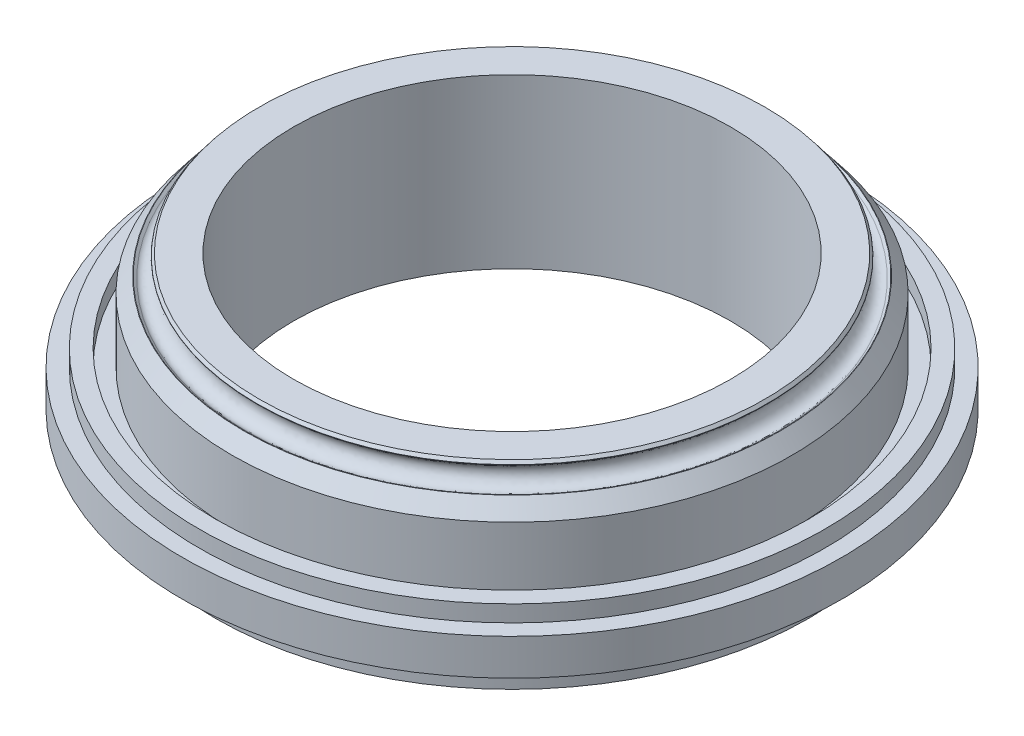
ISO-10303-21;
HEADER;
FILE_DESCRIPTION(('STEP AP214'),'2;1');
FILE_NAME('part.step','',(''),(''),'','','');
FILE_SCHEMA(('AUTOMOTIVE_DESIGN { 1 0 10303 214 1 1 1 1 }'));
ENDSEC;
DATA;
#1=APPLICATION_CONTEXT('core data for automotive mechanical design processes');
#2=APPLICATION_PROTOCOL_DEFINITION('international standard','automotive_design',2000,#1);
#3=PRODUCT_CONTEXT('',#1,'mechanical');
#4=PRODUCT('Part','Part','',(#3));
#5=PRODUCT_RELATED_PRODUCT_CATEGORY('part','',(#4));
#6=PRODUCT_DEFINITION_FORMATION('','',#4);
#7=PRODUCT_DEFINITION_CONTEXT('part definition',#1,'design');
#8=PRODUCT_DEFINITION('design','',#6,#7);
#9=PRODUCT_DEFINITION_SHAPE('','',#8);
#10=(LENGTH_UNIT() NAMED_UNIT(*) SI_UNIT(.MILLI.,.METRE.));
#11=(NAMED_UNIT(*) PLANE_ANGLE_UNIT() SI_UNIT($,.RADIAN.));
#12=(NAMED_UNIT(*) SI_UNIT($,.STERADIAN.) SOLID_ANGLE_UNIT());
#13=UNCERTAINTY_MEASURE_WITH_UNIT(LENGTH_MEASURE(1.E-05),#10,'distance_accuracy_value','');
#14=(GEOMETRIC_REPRESENTATION_CONTEXT(3) GLOBAL_UNCERTAINTY_ASSIGNED_CONTEXT((#13)) GLOBAL_UNIT_ASSIGNED_CONTEXT((#10,
#11,#12)) REPRESENTATION_CONTEXT('',''));
#15=CARTESIAN_POINT('',(0.,0.,0.));
#16=DIRECTION('',(0.,0.,1.));
#17=DIRECTION('',(1.,0.,0.));
#18=AXIS2_PLACEMENT_3D('',#15,#16,#17);
#19=CARTESIAN_POINT('',(78.55,-10.2623786743654,0.));
#20=DIRECTION('',(0.,0.,1.));
#21=DIRECTION('',(1.,0.,0.));
#22=AXIS2_PLACEMENT_3D('',#19,#20,#21);
#23=ELLIPSE('',#22,3.25,2.165);
#24=CARTESIAN_POINT('',(0.,0.,0.));
#25=DIRECTION('',(0.,-1.,0.));
#26=AXIS1_PLACEMENT('',#24,#25);
#27=SURFACE_OF_REVOLUTION('',#23,#26);
#28=CARTESIAN_POINT('',(0.,-10.2623786743654,0.));
#29=DIRECTION('',(0.,-1.,0.));
#30=DIRECTION('',(0.,0.,-1.));
#31=AXIS2_PLACEMENT_3D('',#28,#29,#30);
#32=CIRCLE('',#31,75.3);
#33=CARTESIAN_POINT('',(0.,-10.2623786743654,-75.3));
#34=VERTEX_POINT('',#33);
#35=EDGE_CURVE('E109',#34,#34,#32,.T.);
#36=ORIENTED_EDGE('',*,*,#35,.F.);
#37=EDGE_LOOP('',(#36));
#38=FACE_BOUND('',#37,.T.);
#39=CARTESIAN_POINT('',(0.,-10.2623786743654,0.));
#40=DIRECTION('',(0.,-1.,0.));
#41=DIRECTION('',(0.,0.,-1.));
#42=AXIS2_PLACEMENT_3D('',#39,#40,#41);
#43=CIRCLE('',#42,81.8);
#44=CARTESIAN_POINT('',(0.,-10.2623786743654,-81.8));
#45=VERTEX_POINT('',#44);
#46=EDGE_CURVE('E61',#45,#45,#43,.T.);
#47=ORIENTED_EDGE('',*,*,#46,.T.);
#48=EDGE_LOOP('',(#47));
#49=FACE_BOUND('',#48,.T.);
#50=ADVANCED_FACE('F41',(#38,#49),#27,.T.);
#51=CARTESIAN_POINT('',(0.,-10.2623786743654,0.));
#52=DIRECTION('',(0.,-1.,0.));
#53=DIRECTION('',(0.,0.,-1.));
#54=AXIS2_PLACEMENT_3D('',#51,#52,#53);
#55=PLANE('',#54);
#56=CARTESIAN_POINT('',(0.,-10.2623786743654,85.));
#57=DIRECTION('',(0.,-1.,0.));
#58=DIRECTION('',(0.,0.,-1.));
#59=AXIS2_PLACEMENT_3D('',#56,#57,#58);
#60=CIRCLE('',#59,1.55);
#61=CARTESIAN_POINT('',(0.,-10.2623786743654,83.45));
#62=VERTEX_POINT('',#61);
#63=EDGE_CURVE('E305',#62,#62,#60,.T.);
#64=ORIENTED_EDGE('',*,*,#63,.F.);
#65=EDGE_LOOP('',(#64));
#66=FACE_BOUND('',#65,.T.);
#67=CARTESIAN_POINT('',(-42.4999999999991,-10.2623786743654,73.6121593216778));
#68=DIRECTION('',(0.,-1.,0.));
#69=DIRECTION('',(0.,0.,-1.));
#70=AXIS2_PLACEMENT_3D('',#67,#68,#69);
#71=CIRCLE('',#70,1.55);
#72=CARTESIAN_POINT('',(-42.4999999999991,-10.2623786743654,72.0621593216778));
#73=VERTEX_POINT('',#72);
#74=EDGE_CURVE('E324',#73,#73,#71,.T.);
#75=ORIENTED_EDGE('',*,*,#74,.F.);
#76=EDGE_LOOP('',(#75));
#77=FACE_BOUND('',#76,.T.);
#78=CARTESIAN_POINT('',(-73.6121593216768,-10.2623786743654,42.5000000000009));
#79=DIRECTION('',(0.,-1.,0.));
#80=DIRECTION('',(0.,0.,-1.));
#81=AXIS2_PLACEMENT_3D('',#78,#79,#80);
#82=CIRCLE('',#81,1.54999999999999);
#83=CARTESIAN_POINT('',(-73.6121593216768,-10.2623786743654,40.9500000000009));
#84=VERTEX_POINT('',#83);
#85=EDGE_CURVE('E318',#84,#84,#82,.T.);
#86=ORIENTED_EDGE('',*,*,#85,.F.);
#87=EDGE_LOOP('',(#86));
#88=FACE_BOUND('',#87,.T.);
#89=CARTESIAN_POINT('',(-85.,-10.2623786743654,8.90327741404999E-13));
#90=DIRECTION('',(0.,-1.,0.));
#91=DIRECTION('',(0.,0.,-1.));
#92=AXIS2_PLACEMENT_3D('',#89,#90,#91);
#93=CIRCLE('',#92,1.55);
#94=CARTESIAN_POINT('',(-85.,-10.2623786743654,-1.54999999999911));
#95=VERTEX_POINT('',#94);
#96=EDGE_CURVE('E311',#95,#95,#93,.T.);
#97=ORIENTED_EDGE('',*,*,#96,.F.);
#98=EDGE_LOOP('',(#97));
#99=FACE_BOUND('',#98,.T.);
#100=CARTESIAN_POINT('',(42.5000000000001,-10.2623786743654,73.6121593216772));
#101=DIRECTION('',(0.,-1.,0.));
#102=DIRECTION('',(0.,0.,-1.));
#103=AXIS2_PLACEMENT_3D('',#100,#101,#102);
#104=CIRCLE('',#103,1.55);
#105=CARTESIAN_POINT('',(42.5000000000001,-10.2623786743654,72.0621593216772));
#106=VERTEX_POINT('',#105);
#107=EDGE_CURVE('E308',#106,#106,#104,.T.);
#108=ORIENTED_EDGE('',*,*,#107,.F.);
#109=EDGE_LOOP('',(#108));
#110=FACE_BOUND('',#109,.T.);
#111=CARTESIAN_POINT('',(73.6121593216774,-10.2623786743654,42.4999999999998));
#112=DIRECTION('',(0.,-1.,0.));
#113=DIRECTION('',(0.,0.,-1.));
#114=AXIS2_PLACEMENT_3D('',#111,#112,#113);
#115=CIRCLE('',#114,1.55);
#116=CARTESIAN_POINT('',(73.6121593216774,-10.2623786743654,40.9499999999998));
#117=VERTEX_POINT('',#116);
#118=EDGE_CURVE('E359',#117,#117,#115,.T.);
#119=ORIENTED_EDGE('',*,*,#118,.F.);
#120=EDGE_LOOP('',(#119));
#121=FACE_BOUND('',#120,.T.);
#122=CARTESIAN_POINT('',(85.,-10.2623786743654,-2.96775913801666E-13));
#123=DIRECTION('',(0.,-1.,0.));
#124=DIRECTION('',(0.,0.,-1.));
#125=AXIS2_PLACEMENT_3D('',#122,#123,#124);
#126=CIRCLE('',#125,1.55);
#127=CARTESIAN_POINT('',(85.,-10.2623786743654,-1.5500000000003));
#128=VERTEX_POINT('',#127);
#129=EDGE_CURVE('E365',#128,#128,#126,.T.);
#130=ORIENTED_EDGE('',*,*,#129,.F.);
#131=EDGE_LOOP('',(#130));
#132=FACE_BOUND('',#131,.T.);
#133=CARTESIAN_POINT('',(73.6121593216771,-10.2623786743654,-42.5000000000003));
#134=DIRECTION('',(0.,-1.,0.));
#135=DIRECTION('',(0.,0.,-1.));
#136=AXIS2_PLACEMENT_3D('',#133,#134,#135);
#137=CIRCLE('',#136,1.55000000000001);
#138=CARTESIAN_POINT('',(73.6121593216771,-10.2623786743654,-44.0500000000004));
#139=VERTEX_POINT('',#138);
#140=EDGE_CURVE('E371',#139,#139,#137,.T.);
#141=ORIENTED_EDGE('',*,*,#140,.F.);
#142=EDGE_LOOP('',(#141));
#143=FACE_BOUND('',#142,.T.);
#144=CARTESIAN_POINT('',(42.4999999999996,-10.2623786743654,-73.6121593216776));
#145=DIRECTION('',(0.,-1.,0.));
#146=DIRECTION('',(0.,0.,-1.));
#147=AXIS2_PLACEMENT_3D('',#144,#145,#146);
#148=CIRCLE('',#147,1.55);
#149=CARTESIAN_POINT('',(42.4999999999996,-10.2623786743654,-75.1621593216775));
#150=VERTEX_POINT('',#149);
#151=EDGE_CURVE('E330',#150,#150,#148,.T.);
#152=ORIENTED_EDGE('',*,*,#151,.F.);
#153=EDGE_LOOP('',(#152));
#154=FACE_BOUND('',#153,.T.);
#155=CARTESIAN_POINT('',(-5.93551827603333E-13,-10.2623786743654,-85.));
#156=DIRECTION('',(0.,-1.,0.));
#157=DIRECTION('',(0.,0.,-1.));
#158=AXIS2_PLACEMENT_3D('',#155,#156,#157);
#159=CIRCLE('',#158,1.55);
#160=CARTESIAN_POINT('',(-5.93551827603333E-13,-10.2623786743654,-86.55));
#161=VERTEX_POINT('',#160);
#162=EDGE_CURVE('E337',#161,#161,#159,.T.);
#163=ORIENTED_EDGE('',*,*,#162,.F.);
#164=EDGE_LOOP('',(#163));
#165=FACE_BOUND('',#164,.T.);
#166=CARTESIAN_POINT('',(-42.5000000000006,-10.2623786743654,-73.612159321677));
#167=DIRECTION('',(0.,-1.,0.));
#168=DIRECTION('',(0.,0.,-1.));
#169=AXIS2_PLACEMENT_3D('',#166,#167,#168);
#170=CIRCLE('',#169,1.55);
#171=CARTESIAN_POINT('',(-42.5000000000006,-10.2623786743654,-75.162159321677));
#172=VERTEX_POINT('',#171);
#173=EDGE_CURVE('E343',#172,#172,#170,.T.);
#174=ORIENTED_EDGE('',*,*,#173,.F.);
#175=EDGE_LOOP('',(#174));
#176=FACE_BOUND('',#175,.T.);
#177=CARTESIAN_POINT('',(-73.6121593216777,-10.2623786743654,-42.4999999999993));
#178=DIRECTION('',(0.,-1.,0.));
#179=DIRECTION('',(0.,0.,-1.));
#180=AXIS2_PLACEMENT_3D('',#177,#178,#179);
#181=CIRCLE('',#180,1.54999999999999);
#182=CARTESIAN_POINT('',(-73.6121593216777,-10.2623786743654,-44.0499999999993));
#183=VERTEX_POINT('',#182);
#184=EDGE_CURVE('E349',#183,#183,#181,.T.);
#185=ORIENTED_EDGE('',*,*,#184,.F.);
#186=EDGE_LOOP('',(#185));
#187=FACE_BOUND('',#186,.T.);
#188=CARTESIAN_POINT('',(0.,-10.2623786743654,0.));
#189=DIRECTION('',(0.,-1.,0.));
#190=DIRECTION('',(0.,0.,-1.));
#191=AXIS2_PLACEMENT_3D('',#188,#189,#190);
#192=CIRCLE('',#191,90.);
#193=CARTESIAN_POINT('',(0.,-10.2623786743654,-90.));
#194=VERTEX_POINT('',#193);
#195=EDGE_CURVE('E64',#194,#194,#192,.T.);
#196=ORIENTED_EDGE('',*,*,#195,.T.);
#197=EDGE_LOOP('',(#196));
#198=FACE_BOUND('',#197,.T.);
#199=ORIENTED_EDGE('',*,*,#46,.F.);
#200=EDGE_LOOP('',(#199));
#201=FACE_BOUND('',#200,.T.);
#202=ADVANCED_FACE('F166',(#66,#77,#88,#99,#110,#121,#132,#143,#154,#165,#176,#187,#198,#201),
#55,.T.);
#203=CARTESIAN_POINT('',(0.,0.,0.));
#204=DIRECTION('',(0.,-1.,0.));
#205=DIRECTION('',(0.,0.,-1.));
#206=AXIS2_PLACEMENT_3D('',#203,#204,#205);
#207=CYLINDRICAL_SURFACE('',#206,90.);
#208=CARTESIAN_POINT('',(0.,-0.26237867436537,0.));
#209=DIRECTION('',(0.,-1.,0.));
#210=DIRECTION('',(0.,0.,-1.));
#211=AXIS2_PLACEMENT_3D('',#208,#209,#210);
#212=CIRCLE('',#211,90.);
#213=CARTESIAN_POINT('',(0.,-0.26237867436537,-90.));
#214=VERTEX_POINT('',#213);
#215=EDGE_CURVE('E67',#214,#214,#212,.T.);
#216=ORIENTED_EDGE('',*,*,#215,.T.);
#217=EDGE_LOOP('',(#216));
#218=FACE_BOUND('',#217,.T.);
#219=ORIENTED_EDGE('',*,*,#195,.F.);
#220=EDGE_LOOP('',(#219));
#221=FACE_BOUND('',#220,.T.);
#222=ADVANCED_FACE('F162',(#218,#221),#207,.T.);
#223=CARTESIAN_POINT('',(0.,-0.262378674365373,0.));
#224=DIRECTION('',(0.,-1.,0.));
#225=DIRECTION('',(0.,0.,-1.));
#226=AXIS2_PLACEMENT_3D('',#223,#224,#225);
#227=PLANE('',#226);
#228=CARTESIAN_POINT('',(0.,-0.262378674365377,0.));
#229=DIRECTION('',(0.,-1.,0.));
#230=DIRECTION('',(0.,0.,-1.));
#231=AXIS2_PLACEMENT_3D('',#228,#229,#230);
#232=CIRCLE('',#231,100.);
#233=CARTESIAN_POINT('',(0.,-0.262378674365377,-100.));
#234=VERTEX_POINT('',#233);
#235=EDGE_CURVE('E70',#234,#234,#232,.T.);
#236=ORIENTED_EDGE('',*,*,#235,.T.);
#237=EDGE_LOOP('',(#236));
#238=FACE_BOUND('',#237,.T.);
#239=ORIENTED_EDGE('',*,*,#215,.F.);
#240=EDGE_LOOP('',(#239));
#241=FACE_BOUND('',#240,.T.);
#242=ADVANCED_FACE('F158',(#238,#241),#227,.T.);
#243=CARTESIAN_POINT('',(0.,0.,0.));
#244=DIRECTION('',(0.,-1.,0.));
#245=DIRECTION('',(0.,0.,-1.));
#246=AXIS2_PLACEMENT_3D('',#243,#244,#245);
#247=CYLINDRICAL_SURFACE('',#246,100.);
#248=ORIENTED_EDGE('',*,*,#235,.F.);
#249=EDGE_LOOP('',(#248));
#250=FACE_BOUND('',#249,.T.);
#251=CARTESIAN_POINT('',(0.,10.7376213256346,0.));
#252=DIRECTION('',(0.,-1.,0.));
#253=DIRECTION('',(0.,0.,-1.));
#254=AXIS2_PLACEMENT_3D('',#251,#252,#253);
#255=CIRCLE('',#254,100.);
#256=CARTESIAN_POINT('',(0.,10.7376213256346,-100.));
#257=VERTEX_POINT('',#256);
#258=EDGE_CURVE('E73',#257,#257,#255,.T.);
#259=ORIENTED_EDGE('',*,*,#258,.T.);
#260=EDGE_LOOP('',(#259));
#261=FACE_BOUND('',#260,.T.);
#262=ADVANCED_FACE('F154',(#250,#261),#247,.T.);
#263=CARTESIAN_POINT('',(0.,10.7376213256346,0.));
#264=DIRECTION('',(0.,-1.,0.));
#265=DIRECTION('',(0.,0.,-1.));
#266=AXIS2_PLACEMENT_3D('',#263,#264,#265);
#267=PLANE('',#266);
#268=ORIENTED_EDGE('',*,*,#258,.F.);
#269=EDGE_LOOP('',(#268));
#270=FACE_BOUND('',#269,.T.);
#271=CARTESIAN_POINT('',(0.,10.7376213256346,0.));
#272=DIRECTION('',(0.,-1.,0.));
#273=DIRECTION('',(0.,0.,-1.));
#274=AXIS2_PLACEMENT_3D('',#271,#272,#273);
#275=CIRCLE('',#274,95.);
#276=CARTESIAN_POINT('',(0.,10.7376213256346,-95.));
#277=VERTEX_POINT('',#276);
#278=EDGE_CURVE('E76',#277,#277,#275,.T.);
#279=ORIENTED_EDGE('',*,*,#278,.T.);
#280=EDGE_LOOP('',(#279));
#281=FACE_BOUND('',#280,.T.);
#282=ADVANCED_FACE('F150',(#270,#281),#267,.F.);
#283=CARTESIAN_POINT('',(0.,0.,0.));
#284=DIRECTION('',(0.,-1.,0.));
#285=DIRECTION('',(0.,0.,-1.));
#286=AXIS2_PLACEMENT_3D('',#283,#284,#285);
#287=CYLINDRICAL_SURFACE('',#286,95.);
#288=ORIENTED_EDGE('',*,*,#278,.F.);
#289=EDGE_LOOP('',(#288));
#290=FACE_BOUND('',#289,.T.);
#291=CARTESIAN_POINT('',(0.,15.7376213256346,0.));
#292=DIRECTION('',(0.,-1.,0.));
#293=DIRECTION('',(0.,0.,-1.));
#294=AXIS2_PLACEMENT_3D('',#291,#292,#293);
#295=CIRCLE('',#294,95.);
#296=CARTESIAN_POINT('',(0.,15.7376213256346,-95.));
#297=VERTEX_POINT('',#296);
#298=EDGE_CURVE('E79',#297,#297,#295,.T.);
#299=ORIENTED_EDGE('',*,*,#298,.T.);
#300=EDGE_LOOP('',(#299));
#301=FACE_BOUND('',#300,.T.);
#302=ADVANCED_FACE('F146',(#290,#301),#287,.T.);
#303=CARTESIAN_POINT('',(0.,15.7376213256346,0.));
#304=DIRECTION('',(0.,-1.,0.));
#305=DIRECTION('',(0.,0.,-1.));
#306=AXIS2_PLACEMENT_3D('',#303,#304,#305);
#307=PLANE('',#306);
#308=ORIENTED_EDGE('',*,*,#298,.F.);
#309=EDGE_LOOP('',(#308));
#310=FACE_BOUND('',#309,.T.);
#311=CARTESIAN_POINT('',(0.,15.7376213256346,0.));
#312=DIRECTION('',(0.,-1.,0.));
#313=DIRECTION('',(0.,0.,-1.));
#314=AXIS2_PLACEMENT_3D('',#311,#312,#313);
#315=CIRCLE('',#314,89.9);
#316=CARTESIAN_POINT('',(0.,15.7376213256346,-89.9));
#317=VERTEX_POINT('',#316);
#318=EDGE_CURVE('E82',#317,#317,#315,.T.);
#319=ORIENTED_EDGE('',*,*,#318,.T.);
#320=EDGE_LOOP('',(#319));
#321=FACE_BOUND('',#320,.T.);
#322=ADVANCED_FACE('F142',(#310,#321),#307,.F.);
#323=CARTESIAN_POINT('',(0.,0.,0.));
#324=DIRECTION('',(0.,-1.,0.));
#325=DIRECTION('',(0.,0.,-1.));
#326=AXIS2_PLACEMENT_3D('',#323,#324,#325);
#327=CYLINDRICAL_SURFACE('',#326,89.9);
#328=ORIENTED_EDGE('',*,*,#318,.F.);
#329=EDGE_LOOP('',(#328));
#330=FACE_BOUND('',#329,.T.);
#331=CARTESIAN_POINT('',(0.,10.7376213256346,0.));
#332=DIRECTION('',(0.,-1.,0.));
#333=DIRECTION('',(0.,0.,-1.));
#334=AXIS2_PLACEMENT_3D('',#331,#332,#333);
#335=CIRCLE('',#334,89.9);
#336=CARTESIAN_POINT('',(0.,10.7376213256346,-89.9));
#337=VERTEX_POINT('',#336);
#338=EDGE_CURVE('E85',#337,#337,#335,.T.);
#339=ORIENTED_EDGE('',*,*,#338,.T.);
#340=EDGE_LOOP('',(#339));
#341=FACE_BOUND('',#340,.T.);
#342=ADVANCED_FACE('F138',(#330,#341),#327,.F.);
#343=CARTESIAN_POINT('',(0.,10.7376213256346,0.));
#344=DIRECTION('',(0.,-1.,0.));
#345=DIRECTION('',(0.,0.,-1.));
#346=AXIS2_PLACEMENT_3D('',#343,#344,#345);
#347=PLANE('',#346);
#348=ORIENTED_EDGE('',*,*,#338,.F.);
#349=EDGE_LOOP('',(#348));
#350=FACE_BOUND('',#349,.T.);
#351=CARTESIAN_POINT('',(0.,10.7376213256346,0.));
#352=DIRECTION('',(0.,-1.,0.));
#353=DIRECTION('',(0.,0.,-1.));
#354=AXIS2_PLACEMENT_3D('',#351,#352,#353);
#355=CIRCLE('',#354,84.99);
#356=CARTESIAN_POINT('',(0.,10.7376213256346,-84.99));
#357=VERTEX_POINT('',#356);
#358=EDGE_CURVE('E88',#357,#357,#355,.T.);
#359=ORIENTED_EDGE('',*,*,#358,.T.);
#360=EDGE_LOOP('',(#359));
#361=FACE_BOUND('',#360,.T.);
#362=ADVANCED_FACE('F134',(#350,#361),#347,.F.);
#363=CARTESIAN_POINT('',(0.,0.,0.));
#364=DIRECTION('',(0.,-1.,0.));
#365=DIRECTION('',(0.,0.,-1.));
#366=AXIS2_PLACEMENT_3D('',#363,#364,#365);
#367=CYLINDRICAL_SURFACE('',#366,84.99);
#368=CARTESIAN_POINT('',(0.,30.1174995072672,0.));
#369=DIRECTION('',(0.,-1.,0.));
#370=DIRECTION('',(0.,0.,-1.));
#371=AXIS2_PLACEMENT_3D('',#368,#369,#370);
#372=CIRCLE('',#371,84.99);
#373=CARTESIAN_POINT('',(0.,30.1174995072672,-84.99));
#374=VERTEX_POINT('',#373);
#375=EDGE_CURVE('E91',#374,#374,#372,.T.);
#376=ORIENTED_EDGE('',*,*,#375,.T.);
#377=EDGE_LOOP('',(#376));
#378=FACE_BOUND('',#377,.T.);
#379=ORIENTED_EDGE('',*,*,#358,.F.);
#380=EDGE_LOOP('',(#379));
#381=FACE_BOUND('',#380,.T.);
#382=ADVANCED_FACE('F131',(#378,#381),#367,.T.);
#383=CARTESIAN_POINT('',(0.,34.7953666700846,0.));
#384=DIRECTION('',(0.,-1.,0.));
#385=DIRECTION('',(0.,0.,-1.));
#386=AXIS2_PLACEMENT_3D('',#383,#384,#385);
#387=CONICAL_SURFACE('',#386,81.3640889335616,0.659385391403457);
#388=CARTESIAN_POINT('',(0.,34.7163297791692,0.));
#389=DIRECTION('',(0.,1.,0.));
#390=DIRECTION('',(0.,0.,1.));
#391=AXIS2_PLACEMENT_3D('',#388,#389,#390);
#392=CIRCLE('',#391,81.4253520535803);
#393=CARTESIAN_POINT('',(0.,34.7163297791692,81.4253520535803));
#394=VERTEX_POINT('',#393);
#395=EDGE_CURVE('E48',#394,#394,#392,.F.);
#396=ORIENTED_EDGE('',*,*,#395,.T.);
#397=EDGE_LOOP('',(#396));
#398=FACE_BOUND('',#397,.T.);
#399=ORIENTED_EDGE('',*,*,#375,.F.);
#400=EDGE_LOOP('',(#399));
#401=FACE_BOUND('',#400,.T.);
#402=ADVANCED_FACE('F128',(#398,#401),#387,.T.);
#403=CARTESIAN_POINT('',(0.,34.1423018106855,0.));
#404=DIRECTION('',(0.,1.,0.));
#405=DIRECTION('',(0.,0.,1.));
#406=AXIS2_PLACEMENT_3D('',#403,#404,#405);
#407=CONICAL_SURFACE('',#406,80.5215556764033,0.911410935391438);
#408=CARTESIAN_POINT('',(0.,34.7341035500659,0.));
#409=DIRECTION('',(0.,-1.,0.));
#410=DIRECTION('',(0.,0.,-1.));
#411=AXIS2_PLACEMENT_3D('',#408,#409,#410);
#412=CIRCLE('',#411,81.2850520426462);
#413=CARTESIAN_POINT('',(0.,34.7341035500659,-81.2850520426462));
#414=VERTEX_POINT('',#413);
#415=EDGE_CURVE('E10',#414,#414,#412,.F.);
#416=ORIENTED_EDGE('',*,*,#415,.T.);
#417=EDGE_LOOP('',(#416));
#418=FACE_BOUND('',#417,.T.);
#419=CARTESIAN_POINT('',(0.,34.1423018106855,0.));
#420=DIRECTION('',(0.,-1.,0.));
#421=DIRECTION('',(0.,0.,-1.));
#422=AXIS2_PLACEMENT_3D('',#419,#420,#421);
#423=CIRCLE('',#422,80.5215556764033);
#424=CARTESIAN_POINT('',(0.,34.1423018106855,-80.5215556764033));
#425=VERTEX_POINT('',#424);
#426=EDGE_CURVE('E94',#425,#425,#423,.T.);
#427=ORIENTED_EDGE('',*,*,#426,.T.);
#428=EDGE_LOOP('',(#427));
#429=FACE_BOUND('',#428,.T.);
#430=ADVANCED_FACE('F123',(#418,#429),#407,.F.);
#431=CARTESIAN_POINT('',(78.5764516158101,36.6517230972502,0.));
#432=DIRECTION('',(0.,0.,1.));
#433=DIRECTION('',(-0.612631200186792,0.790368909154258,0.));
#434=AXIS2_PLACEMENT_3D('',#431,#432,#433);
#435=ELLIPSE('',#434,3.17500000000002,2.67499999999992);
#436=CARTESIAN_POINT('',(0.,0.,0.));
#437=DIRECTION('',(0.,-1.,0.));
#438=AXIS1_PLACEMENT('',#436,#437);
#439=SURFACE_OF_REVOLUTION('',#435,#438);
#440=ORIENTED_EDGE('',*,*,#426,.F.);
#441=EDGE_LOOP('',(#440));
#442=FACE_BOUND('',#441,.T.);
#443=CARTESIAN_POINT('',(0.,39.161144383815,0.));
#444=DIRECTION('',(0.,-1.,0.));
#445=DIRECTION('',(0.,0.,-1.));
#446=AXIS2_PLACEMENT_3D('',#443,#444,#445);
#447=CIRCLE('',#446,76.631347555217);
#448=CARTESIAN_POINT('',(0.,39.161144383815,-76.631347555217));
#449=VERTEX_POINT('',#448);
#450=EDGE_CURVE('E97',#449,#449,#447,.T.);
#451=ORIENTED_EDGE('',*,*,#450,.T.);
#452=EDGE_LOOP('',(#451));
#453=FACE_BOUND('',#452,.T.);
#454=ADVANCED_FACE('F118',(#442,#453),#439,.T.);
#455=CARTESIAN_POINT('',(0.,39.161144383815,0.));
#456=DIRECTION('',(0.,1.,0.));
#457=DIRECTION('',(0.,0.,1.));
#458=AXIS2_PLACEMENT_3D('',#455,#456,#457);
#459=CONICAL_SURFACE('',#458,76.631347555217,0.911410935391446);
#460=CARTESIAN_POINT('',(0.,39.7529461231954,0.));
#461=DIRECTION('',(0.,1.,0.));
#462=DIRECTION('',(0.,0.,1.));
#463=AXIS2_PLACEMENT_3D('',#460,#461,#462);
#464=CIRCLE('',#463,77.39484392146);
#465=CARTESIAN_POINT('',(0.,39.7529461231954,77.39484392146));
#466=VERTEX_POINT('',#465);
#467=EDGE_CURVE('E56',#466,#466,#464,.F.);
#468=ORIENTED_EDGE('',*,*,#467,.T.);
#469=EDGE_LOOP('',(#468));
#470=FACE_BOUND('',#469,.T.);
#471=ORIENTED_EDGE('',*,*,#450,.F.);
#472=EDGE_LOOP('',(#471));
#473=FACE_BOUND('',#472,.T.);
#474=ADVANCED_FACE('F122',(#470,#473),#459,.T.);
#475=CARTESIAN_POINT('',(0.,40.74810371,0.));
#476=DIRECTION('',(0.,-1.,0.));
#477=DIRECTION('',(0.,0.,-1.));
#478=AXIS2_PLACEMENT_3D('',#475,#476,#477);
#479=CONICAL_SURFACE('',#478,76.75,0.659385391403443);
#480=CARTESIAN_POINT('',(0.,39.8932461341295,0.));
#481=DIRECTION('',(0.,-1.,0.));
#482=DIRECTION('',(0.,0.,-1.));
#483=AXIS2_PLACEMENT_3D('',#480,#481,#482);
#484=CIRCLE('',#483,77.4126176923568);
#485=CARTESIAN_POINT('',(0.,39.8932461341295,-77.4126176923568));
#486=VERTEX_POINT('',#485);
#487=EDGE_CURVE('E52',#486,#486,#484,.F.);
#488=ORIENTED_EDGE('',*,*,#487,.T.);
#489=EDGE_LOOP('',(#488));
#490=FACE_BOUND('',#489,.T.);
#491=CARTESIAN_POINT('',(0.,40.74810371,0.));
#492=DIRECTION('',(0.,-1.,0.));
#493=DIRECTION('',(0.,0.,-1.));
#494=AXIS2_PLACEMENT_3D('',#491,#492,#493);
#495=CIRCLE('',#494,76.75);
#496=CARTESIAN_POINT('',(0.,40.74810371,-76.75));
#497=VERTEX_POINT('',#496);
#498=EDGE_CURVE('E100',#497,#497,#495,.T.);
#499=ORIENTED_EDGE('',*,*,#498,.T.);
#500=EDGE_LOOP('',(#499));
#501=FACE_BOUND('',#500,.T.);
#502=ADVANCED_FACE('F190',(#490,#501),#479,.T.);
#503=CARTESIAN_POINT('',(0.,40.74810371,0.));
#504=DIRECTION('',(0.,-1.,0.));
#505=DIRECTION('',(0.,0.,-1.));
#506=AXIS2_PLACEMENT_3D('',#503,#504,#505);
#507=PLANE('',#506);
#508=ORIENTED_EDGE('',*,*,#498,.F.);
#509=EDGE_LOOP('',(#508));
#510=FACE_BOUND('',#509,.T.);
#511=CARTESIAN_POINT('',(0.,40.74810371,0.));
#512=DIRECTION('',(0.,-1.,0.));
#513=DIRECTION('',(0.,0.,-1.));
#514=AXIS2_PLACEMENT_3D('',#511,#512,#513);
#515=CIRCLE('',#514,66.3264516158101);
#516=CARTESIAN_POINT('',(0.,40.74810371,-66.3264516158101));
#517=VERTEX_POINT('',#516);
#518=EDGE_CURVE('E103',#517,#517,#515,.T.);
#519=ORIENTED_EDGE('',*,*,#518,.T.);
#520=EDGE_LOOP('',(#519));
#521=FACE_BOUND('',#520,.T.);
#522=ADVANCED_FACE('F195',(#510,#521),#507,.F.);
#523=CARTESIAN_POINT('',(0.,0.,0.));
#524=DIRECTION('',(0.,-1.,0.));
#525=DIRECTION('',(0.,0.,-1.));
#526=AXIS2_PLACEMENT_3D('',#523,#524,#525);
#527=CYLINDRICAL_SURFACE('',#526,66.3264516158101);
#528=CARTESIAN_POINT('',(0.,-10.2623786743654,0.));
#529=DIRECTION('',(0.,-1.,0.));
#530=DIRECTION('',(0.,0.,-1.));
#531=AXIS2_PLACEMENT_3D('',#528,#529,#530);
#532=CIRCLE('',#531,66.3264516158101);
#533=CARTESIAN_POINT('',(0.,-10.2623786743654,-66.3264516158101));
#534=VERTEX_POINT('',#533);
#535=EDGE_CURVE('E106',#534,#534,#532,.T.);
#536=ORIENTED_EDGE('',*,*,#535,.T.);
#537=EDGE_LOOP('',(#536));
#538=FACE_BOUND('',#537,.T.);
#539=ORIENTED_EDGE('',*,*,#518,.F.);
#540=EDGE_LOOP('',(#539));
#541=FACE_BOUND('',#540,.T.);
#542=ADVANCED_FACE('F181',(#538,#541),#527,.F.);
#543=ORIENTED_EDGE('',*,*,#35,.T.);
#544=EDGE_LOOP('',(#543));
#545=FACE_BOUND('',#544,.T.);
#546=ORIENTED_EDGE('',*,*,#535,.F.);
#547=EDGE_LOOP('',(#546));
#548=FACE_BOUND('',#547,.T.);
#549=ADVANCED_FACE('F172',(#545,#548),#55,.T.);
#550=CARTESIAN_POINT('',(0.,39.8319830141108,0.));
#551=DIRECTION('',(0.,1.,0.));
#552=DIRECTION('',(0.,0.,1.));
#553=AXIS2_PLACEMENT_3D('',#550,#551,#552);
#554=TOROIDAL_SURFACE('',#553,77.3335808014413,0.1);
#555=ORIENTED_EDGE('',*,*,#487,.F.);
#556=EDGE_LOOP('',(#555));
#557=FACE_BOUND('',#556,.T.);
#558=ORIENTED_EDGE('',*,*,#467,.F.);
#559=EDGE_LOOP('',(#558));
#560=FACE_BOUND('',#559,.T.);
#561=ADVANCED_FACE('F170',(#557,#560),#554,.T.);
#562=CARTESIAN_POINT('',(0.,34.6550666591505,0.));
#563=DIRECTION('',(0.,1.,0.));
#564=DIRECTION('',(0.,0.,1.));
#565=AXIS2_PLACEMENT_3D('',#562,#563,#564);
#566=TOROIDAL_SURFACE('',#565,81.3463151626649,0.1);
#567=ORIENTED_EDGE('',*,*,#415,.F.);
#568=EDGE_LOOP('',(#567));
#569=FACE_BOUND('',#568,.T.);
#570=ORIENTED_EDGE('',*,*,#395,.F.);
#571=EDGE_LOOP('',(#570));
#572=FACE_BOUND('',#571,.T.);
#573=ADVANCED_FACE('F43',(#569,#572),#566,.T.);
#574=CARTESIAN_POINT('',(-73.6121593216777,-0.262378674365356,-42.4999999999993));
#575=DIRECTION('',(0.,-1.,0.));
#576=DIRECTION('',(0.,0.,-1.));
#577=AXIS2_PLACEMENT_3D('',#574,#575,#576);
#578=CYLINDRICAL_SURFACE('',#577,1.54999999999999);
#579=CARTESIAN_POINT('',(-73.6121593216777,-0.262378674365356,-42.4999999999993));
#580=DIRECTION('',(0.,-1.,0.));
#581=DIRECTION('',(0.,0.,-1.));
#582=AXIS2_PLACEMENT_3D('',#579,#580,#581);
#583=CIRCLE('',#582,1.54999999999999);
#584=CARTESIAN_POINT('',(-73.6121593216777,-0.262378674365356,-44.0499999999993));
#585=VERTEX_POINT('',#584);
#586=EDGE_CURVE('E314',#585,#585,#583,.T.);
#587=ORIENTED_EDGE('',*,*,#586,.F.);
#588=EDGE_LOOP('',(#587));
#589=FACE_BOUND('',#588,.T.);
#590=ORIENTED_EDGE('',*,*,#184,.T.);
#591=EDGE_LOOP('',(#590));
#592=FACE_BOUND('',#591,.T.);
#593=ADVANCED_FACE('F178',(#589,#592),#578,.F.);
#594=CARTESIAN_POINT('',(-73.6121593216777,-0.262378674365356,-42.4999999999993));
#595=DIRECTION('',(0.,-1.,0.));
#596=DIRECTION('',(0.,0.,-1.));
#597=AXIS2_PLACEMENT_3D('',#594,#595,#596);
#598=PLANE('',#597);
#599=ORIENTED_EDGE('',*,*,#586,.T.);
#600=EDGE_LOOP('',(#599));
#601=FACE_BOUND('',#600,.T.);
#602=ADVANCED_FACE('F241',(#601),#598,.T.);
#603=CARTESIAN_POINT('',(-42.5000000000006,-0.262378674365356,-73.612159321677));
#604=DIRECTION('',(0.,-1.,0.));
#605=DIRECTION('',(0.,0.,-1.));
#606=AXIS2_PLACEMENT_3D('',#603,#604,#605);
#607=CYLINDRICAL_SURFACE('',#606,1.55);
#608=CARTESIAN_POINT('',(-42.5000000000006,-0.262378674365356,-73.612159321677));
#609=DIRECTION('',(0.,-1.,0.));
#610=DIRECTION('',(0.,0.,-1.));
#611=AXIS2_PLACEMENT_3D('',#608,#609,#610);
#612=CIRCLE('',#611,1.55);
#613=CARTESIAN_POINT('',(-42.5000000000006,-0.262378674365356,-75.162159321677));
#614=VERTEX_POINT('',#613);
#615=EDGE_CURVE('E346',#614,#614,#612,.T.);
#616=ORIENTED_EDGE('',*,*,#615,.F.);
#617=EDGE_LOOP('',(#616));
#618=FACE_BOUND('',#617,.T.);
#619=ORIENTED_EDGE('',*,*,#173,.T.);
#620=EDGE_LOOP('',(#619));
#621=FACE_BOUND('',#620,.T.);
#622=ADVANCED_FACE('F244',(#618,#621),#607,.F.);
#623=CARTESIAN_POINT('',(-42.5000000000006,-0.262378674365356,-73.612159321677));
#624=DIRECTION('',(0.,-1.,0.));
#625=DIRECTION('',(0.,0.,-1.));
#626=AXIS2_PLACEMENT_3D('',#623,#624,#625);
#627=PLANE('',#626);
#628=ORIENTED_EDGE('',*,*,#615,.T.);
#629=EDGE_LOOP('',(#628));
#630=FACE_BOUND('',#629,.T.);
#631=ADVANCED_FACE('F249',(#630),#627,.T.);
#632=CARTESIAN_POINT('',(-5.93551827603333E-13,-0.262378674365356,-85.));
#633=DIRECTION('',(0.,-1.,0.));
#634=DIRECTION('',(0.,0.,-1.));
#635=AXIS2_PLACEMENT_3D('',#632,#633,#634);
#636=CYLINDRICAL_SURFACE('',#635,1.55);
#637=CARTESIAN_POINT('',(-5.93551827603333E-13,-0.262378674365356,-85.));
#638=DIRECTION('',(0.,-1.,0.));
#639=DIRECTION('',(0.,0.,-1.));
#640=AXIS2_PLACEMENT_3D('',#637,#638,#639);
#641=CIRCLE('',#640,1.55);
#642=CARTESIAN_POINT('',(-5.93551827603333E-13,-0.262378674365356,-86.55));
#643=VERTEX_POINT('',#642);
#644=EDGE_CURVE('E340',#643,#643,#641,.T.);
#645=ORIENTED_EDGE('',*,*,#644,.F.);
#646=EDGE_LOOP('',(#645));
#647=FACE_BOUND('',#646,.T.);
#648=ORIENTED_EDGE('',*,*,#162,.T.);
#649=EDGE_LOOP('',(#648));
#650=FACE_BOUND('',#649,.T.);
#651=ADVANCED_FACE('F252',(#647,#650),#636,.F.);
#652=CARTESIAN_POINT('',(-5.93551827603333E-13,-0.262378674365356,-85.));
#653=DIRECTION('',(0.,-1.,0.));
#654=DIRECTION('',(0.,0.,-1.));
#655=AXIS2_PLACEMENT_3D('',#652,#653,#654);
#656=PLANE('',#655);
#657=ORIENTED_EDGE('',*,*,#644,.T.);
#658=EDGE_LOOP('',(#657));
#659=FACE_BOUND('',#658,.T.);
#660=ADVANCED_FACE('F257',(#659),#656,.T.);
#661=CARTESIAN_POINT('',(42.4999999999996,-0.262378674365356,-73.6121593216776));
#662=DIRECTION('',(0.,-1.,0.));
#663=DIRECTION('',(0.,0.,-1.));
#664=AXIS2_PLACEMENT_3D('',#661,#662,#663);
#665=CYLINDRICAL_SURFACE('',#664,1.55);
#666=CARTESIAN_POINT('',(42.4999999999996,-0.262378674365356,-73.6121593216776));
#667=DIRECTION('',(0.,-1.,0.));
#668=DIRECTION('',(0.,0.,-1.));
#669=AXIS2_PLACEMENT_3D('',#666,#667,#668);
#670=CIRCLE('',#669,1.55);
#671=CARTESIAN_POINT('',(42.4999999999996,-0.262378674365356,-75.1621593216775));
#672=VERTEX_POINT('',#671);
#673=EDGE_CURVE('E334',#672,#672,#670,.T.);
#674=ORIENTED_EDGE('',*,*,#673,.F.);
#675=EDGE_LOOP('',(#674));
#676=FACE_BOUND('',#675,.T.);
#677=ORIENTED_EDGE('',*,*,#151,.T.);
#678=EDGE_LOOP('',(#677));
#679=FACE_BOUND('',#678,.T.);
#680=ADVANCED_FACE('F260',(#676,#679),#665,.F.);
#681=CARTESIAN_POINT('',(42.4999999999996,-0.262378674365356,-73.6121593216776));
#682=DIRECTION('',(0.,-1.,0.));
#683=DIRECTION('',(0.,0.,-1.));
#684=AXIS2_PLACEMENT_3D('',#681,#682,#683);
#685=PLANE('',#684);
#686=ORIENTED_EDGE('',*,*,#673,.T.);
#687=EDGE_LOOP('',(#686));
#688=FACE_BOUND('',#687,.T.);
#689=ADVANCED_FACE('F215',(#688),#685,.T.);
#690=CARTESIAN_POINT('',(73.6121593216771,-0.262378674365356,-42.5000000000003));
#691=DIRECTION('',(0.,-1.,0.));
#692=DIRECTION('',(0.,0.,-1.));
#693=AXIS2_PLACEMENT_3D('',#690,#691,#692);
#694=CYLINDRICAL_SURFACE('',#693,1.55000000000001);
#695=CARTESIAN_POINT('',(73.6121593216771,-0.262378674365356,-42.5000000000003));
#696=DIRECTION('',(0.,-1.,0.));
#697=DIRECTION('',(0.,0.,-1.));
#698=AXIS2_PLACEMENT_3D('',#695,#696,#697);
#699=CIRCLE('',#698,1.55000000000001);
#700=CARTESIAN_POINT('',(73.6121593216771,-0.262378674365356,-44.0500000000004));
#701=VERTEX_POINT('',#700);
#702=EDGE_CURVE('E333',#701,#701,#699,.T.);
#703=ORIENTED_EDGE('',*,*,#702,.F.);
#704=EDGE_LOOP('',(#703));
#705=FACE_BOUND('',#704,.T.);
#706=ORIENTED_EDGE('',*,*,#140,.T.);
#707=EDGE_LOOP('',(#706));
#708=FACE_BOUND('',#707,.T.);
#709=ADVANCED_FACE('F211',(#705,#708),#694,.F.);
#710=CARTESIAN_POINT('',(73.6121593216771,-0.262378674365356,-42.5000000000003));
#711=DIRECTION('',(0.,-1.,0.));
#712=DIRECTION('',(0.,0.,-1.));
#713=AXIS2_PLACEMENT_3D('',#710,#711,#712);
#714=PLANE('',#713);
#715=ORIENTED_EDGE('',*,*,#702,.T.);
#716=EDGE_LOOP('',(#715));
#717=FACE_BOUND('',#716,.T.);
#718=ADVANCED_FACE('F207',(#717),#714,.T.);
#719=CARTESIAN_POINT('',(85.,-0.262378674365356,-2.96775913801666E-13));
#720=DIRECTION('',(0.,-1.,0.));
#721=DIRECTION('',(0.,0.,-1.));
#722=AXIS2_PLACEMENT_3D('',#719,#720,#721);
#723=CYLINDRICAL_SURFACE('',#722,1.55);
#724=CARTESIAN_POINT('',(85.,-0.262378674365356,-2.96775913801666E-13));
#725=DIRECTION('',(0.,-1.,0.));
#726=DIRECTION('',(0.,0.,-1.));
#727=AXIS2_PLACEMENT_3D('',#724,#725,#726);
#728=CIRCLE('',#727,1.55);
#729=CARTESIAN_POINT('',(85.,-0.262378674365356,-1.5500000000003));
#730=VERTEX_POINT('',#729);
#731=EDGE_CURVE('E368',#730,#730,#728,.T.);
#732=ORIENTED_EDGE('',*,*,#731,.F.);
#733=EDGE_LOOP('',(#732));
#734=FACE_BOUND('',#733,.T.);
#735=ORIENTED_EDGE('',*,*,#129,.T.);
#736=EDGE_LOOP('',(#735));
#737=FACE_BOUND('',#736,.T.);
#738=ADVANCED_FACE('F210',(#734,#737),#723,.F.);
#739=CARTESIAN_POINT('',(85.,-0.262378674365356,-2.96775913801666E-13));
#740=DIRECTION('',(0.,-1.,0.));
#741=DIRECTION('',(0.,0.,-1.));
#742=AXIS2_PLACEMENT_3D('',#739,#740,#741);
#743=PLANE('',#742);
#744=ORIENTED_EDGE('',*,*,#731,.T.);
#745=EDGE_LOOP('',(#744));
#746=FACE_BOUND('',#745,.T.);
#747=ADVANCED_FACE('F217',(#746),#743,.T.);
#748=CARTESIAN_POINT('',(73.6121593216774,-0.262378674365356,42.4999999999998));
#749=DIRECTION('',(0.,-1.,0.));
#750=DIRECTION('',(0.,0.,-1.));
#751=AXIS2_PLACEMENT_3D('',#748,#749,#750);
#752=CYLINDRICAL_SURFACE('',#751,1.55);
#753=CARTESIAN_POINT('',(73.6121593216774,-0.262378674365356,42.4999999999998));
#754=DIRECTION('',(0.,-1.,0.));
#755=DIRECTION('',(0.,0.,-1.));
#756=AXIS2_PLACEMENT_3D('',#753,#754,#755);
#757=CIRCLE('',#756,1.55);
#758=CARTESIAN_POINT('',(73.6121593216774,-0.262378674365356,40.9499999999998));
#759=VERTEX_POINT('',#758);
#760=EDGE_CURVE('E362',#759,#759,#757,.T.);
#761=ORIENTED_EDGE('',*,*,#760,.F.);
#762=EDGE_LOOP('',(#761));
#763=FACE_BOUND('',#762,.T.);
#764=ORIENTED_EDGE('',*,*,#118,.T.);
#765=EDGE_LOOP('',(#764));
#766=FACE_BOUND('',#765,.T.);
#767=ADVANCED_FACE('F220',(#763,#766),#752,.F.);
#768=CARTESIAN_POINT('',(73.6121593216774,-0.262378674365356,42.4999999999998));
#769=DIRECTION('',(0.,-1.,0.));
#770=DIRECTION('',(0.,0.,-1.));
#771=AXIS2_PLACEMENT_3D('',#768,#769,#770);
#772=PLANE('',#771);
#773=ORIENTED_EDGE('',*,*,#760,.T.);
#774=EDGE_LOOP('',(#773));
#775=FACE_BOUND('',#774,.T.);
#776=ADVANCED_FACE('F225',(#775),#772,.T.);
#777=CARTESIAN_POINT('',(42.5000000000001,-0.262378674365356,73.6121593216772));
#778=DIRECTION('',(0.,-1.,0.));
#779=DIRECTION('',(0.,0.,-1.));
#780=AXIS2_PLACEMENT_3D('',#777,#778,#779);
#781=CYLINDRICAL_SURFACE('',#780,1.55);
#782=CARTESIAN_POINT('',(42.5000000000001,-0.262378674365356,73.6121593216772));
#783=DIRECTION('',(0.,-1.,0.));
#784=DIRECTION('',(0.,0.,-1.));
#785=AXIS2_PLACEMENT_3D('',#782,#783,#784);
#786=CIRCLE('',#785,1.55);
#787=CARTESIAN_POINT('',(42.5000000000001,-0.262378674365356,72.0621593216772));
#788=VERTEX_POINT('',#787);
#789=EDGE_CURVE('E356',#788,#788,#786,.T.);
#790=ORIENTED_EDGE('',*,*,#789,.F.);
#791=EDGE_LOOP('',(#790));
#792=FACE_BOUND('',#791,.T.);
#793=ORIENTED_EDGE('',*,*,#107,.T.);
#794=EDGE_LOOP('',(#793));
#795=FACE_BOUND('',#794,.T.);
#796=ADVANCED_FACE('F228',(#792,#795),#781,.F.);
#797=CARTESIAN_POINT('',(42.5000000000001,-0.262378674365356,73.6121593216772));
#798=DIRECTION('',(0.,-1.,0.));
#799=DIRECTION('',(0.,0.,-1.));
#800=AXIS2_PLACEMENT_3D('',#797,#798,#799);
#801=PLANE('',#800);
#802=ORIENTED_EDGE('',*,*,#789,.T.);
#803=EDGE_LOOP('',(#802));
#804=FACE_BOUND('',#803,.T.);
#805=ADVANCED_FACE('F233',(#804),#801,.T.);
#806=CARTESIAN_POINT('',(-85.,-0.262378674365356,8.90327741404999E-13));
#807=DIRECTION('',(0.,-1.,0.));
#808=DIRECTION('',(0.,0.,-1.));
#809=AXIS2_PLACEMENT_3D('',#806,#807,#808);
#810=CYLINDRICAL_SURFACE('',#809,1.55);
#811=CARTESIAN_POINT('',(-85.,-0.262378674365356,8.90327741404999E-13));
#812=DIRECTION('',(0.,-1.,0.));
#813=DIRECTION('',(0.,0.,-1.));
#814=AXIS2_PLACEMENT_3D('',#811,#812,#813);
#815=CIRCLE('',#814,1.55);
#816=CARTESIAN_POINT('',(-85.,-0.262378674365356,-1.54999999999911));
#817=VERTEX_POINT('',#816);
#818=EDGE_CURVE('E315',#817,#817,#815,.T.);
#819=ORIENTED_EDGE('',*,*,#818,.F.);
#820=EDGE_LOOP('',(#819));
#821=FACE_BOUND('',#820,.T.);
#822=ORIENTED_EDGE('',*,*,#96,.T.);
#823=EDGE_LOOP('',(#822));
#824=FACE_BOUND('',#823,.T.);
#825=ADVANCED_FACE('F236',(#821,#824),#810,.F.);
#826=CARTESIAN_POINT('',(-85.,-0.262378674365356,8.90327741404999E-13));
#827=DIRECTION('',(0.,-1.,0.));
#828=DIRECTION('',(0.,0.,-1.));
#829=AXIS2_PLACEMENT_3D('',#826,#827,#828);
#830=PLANE('',#829);
#831=ORIENTED_EDGE('',*,*,#818,.T.);
#832=EDGE_LOOP('',(#831));
#833=FACE_BOUND('',#832,.T.);
#834=ADVANCED_FACE('F287',(#833),#830,.T.);
#835=CARTESIAN_POINT('',(-73.6121593216768,-0.262378674365356,42.5000000000009));
#836=DIRECTION('',(0.,-1.,0.));
#837=DIRECTION('',(0.,0.,-1.));
#838=AXIS2_PLACEMENT_3D('',#835,#836,#837);
#839=CYLINDRICAL_SURFACE('',#838,1.54999999999999);
#840=CARTESIAN_POINT('',(-73.6121593216768,-0.262378674365356,42.5000000000009));
#841=DIRECTION('',(0.,-1.,0.));
#842=DIRECTION('',(0.,0.,-1.));
#843=AXIS2_PLACEMENT_3D('',#840,#841,#842);
#844=CIRCLE('',#843,1.54999999999999);
#845=CARTESIAN_POINT('',(-73.6121593216768,-0.262378674365356,40.9500000000009));
#846=VERTEX_POINT('',#845);
#847=EDGE_CURVE('E321',#846,#846,#844,.T.);
#848=ORIENTED_EDGE('',*,*,#847,.F.);
#849=EDGE_LOOP('',(#848));
#850=FACE_BOUND('',#849,.T.);
#851=ORIENTED_EDGE('',*,*,#85,.T.);
#852=EDGE_LOOP('',(#851));
#853=FACE_BOUND('',#852,.T.);
#854=ADVANCED_FACE('F283',(#850,#853),#839,.F.);
#855=CARTESIAN_POINT('',(-73.6121593216768,-0.262378674365356,42.5000000000009));
#856=DIRECTION('',(0.,-1.,0.));
#857=DIRECTION('',(0.,0.,-1.));
#858=AXIS2_PLACEMENT_3D('',#855,#856,#857);
#859=PLANE('',#858);
#860=ORIENTED_EDGE('',*,*,#847,.T.);
#861=EDGE_LOOP('',(#860));
#862=FACE_BOUND('',#861,.T.);
#863=ADVANCED_FACE('F279',(#862),#859,.T.);
#864=CARTESIAN_POINT('',(-42.4999999999991,-0.262378674365356,73.6121593216778));
#865=DIRECTION('',(0.,-1.,0.));
#866=DIRECTION('',(0.,0.,-1.));
#867=AXIS2_PLACEMENT_3D('',#864,#865,#866);
#868=CYLINDRICAL_SURFACE('',#867,1.55);
#869=CARTESIAN_POINT('',(-42.4999999999991,-0.262378674365356,73.6121593216778));
#870=DIRECTION('',(0.,-1.,0.));
#871=DIRECTION('',(0.,0.,-1.));
#872=AXIS2_PLACEMENT_3D('',#869,#870,#871);
#873=CIRCLE('',#872,1.55);
#874=CARTESIAN_POINT('',(-42.4999999999991,-0.262378674365356,72.0621593216778));
#875=VERTEX_POINT('',#874);
#876=EDGE_CURVE('E327',#875,#875,#873,.T.);
#877=ORIENTED_EDGE('',*,*,#876,.F.);
#878=EDGE_LOOP('',(#877));
#879=FACE_BOUND('',#878,.T.);
#880=ORIENTED_EDGE('',*,*,#74,.T.);
#881=EDGE_LOOP('',(#880));
#882=FACE_BOUND('',#881,.T.);
#883=ADVANCED_FACE('F275',(#879,#882),#868,.F.);
#884=CARTESIAN_POINT('',(-42.4999999999991,-0.262378674365356,73.6121593216778));
#885=DIRECTION('',(0.,-1.,0.));
#886=DIRECTION('',(0.,0.,-1.));
#887=AXIS2_PLACEMENT_3D('',#884,#885,#886);
#888=PLANE('',#887);
#889=ORIENTED_EDGE('',*,*,#876,.T.);
#890=EDGE_LOOP('',(#889));
#891=FACE_BOUND('',#890,.T.);
#892=ADVANCED_FACE('F271',(#891),#888,.T.);
#893=CARTESIAN_POINT('',(0.,-0.262378674365356,85.));
#894=DIRECTION('',(0.,-1.,0.));
#895=DIRECTION('',(0.,0.,-1.));
#896=AXIS2_PLACEMENT_3D('',#893,#894,#895);
#897=CYLINDRICAL_SURFACE('',#896,1.55);
#898=CARTESIAN_POINT('',(0.,-0.262378674365356,85.));
#899=DIRECTION('',(0.,-1.,0.));
#900=DIRECTION('',(0.,0.,-1.));
#901=AXIS2_PLACEMENT_3D('',#898,#899,#900);
#902=CIRCLE('',#901,1.55);
#903=CARTESIAN_POINT('',(0.,-0.262378674365356,83.45));
#904=VERTEX_POINT('',#903);
#905=EDGE_CURVE('E112',#904,#904,#902,.T.);
#906=ORIENTED_EDGE('',*,*,#905,.F.);
#907=EDGE_LOOP('',(#906));
#908=FACE_BOUND('',#907,.T.);
#909=ORIENTED_EDGE('',*,*,#63,.T.);
#910=EDGE_LOOP('',(#909));
#911=FACE_BOUND('',#910,.T.);
#912=ADVANCED_FACE('F274',(#908,#911),#897,.F.);
#913=CARTESIAN_POINT('',(0.,-0.262378674365356,85.));
#914=DIRECTION('',(0.,-1.,0.));
#915=DIRECTION('',(0.,0.,-1.));
#916=AXIS2_PLACEMENT_3D('',#913,#914,#915);
#917=PLANE('',#916);
#918=ORIENTED_EDGE('',*,*,#905,.T.);
#919=EDGE_LOOP('',(#918));
#920=FACE_BOUND('',#919,.T.);
#921=ADVANCED_FACE('F297',(#920),#917,.T.);
#922=CLOSED_SHELL('',(#50,#202,#222,#242,#262,#282,#302,#322,#342,#362,#382,#402,#430,#454,#474,
#502,#522,#542,#549,#561,#573,#593,#602,#622,#631,#651,#660,#680,#689,#709,#718,#738,#747,#767,
#776,#796,#805,#825,#834,#854,#863,#883,#892,#912,#921));
#923=MANIFOLD_SOLID_BREP('B2',#922);
#924=ADVANCED_BREP_SHAPE_REPRESENTATION('',(#18,#923),#14);
#925=SHAPE_DEFINITION_REPRESENTATION(#9,#924);
ENDSEC;
END-ISO-10303-21;
